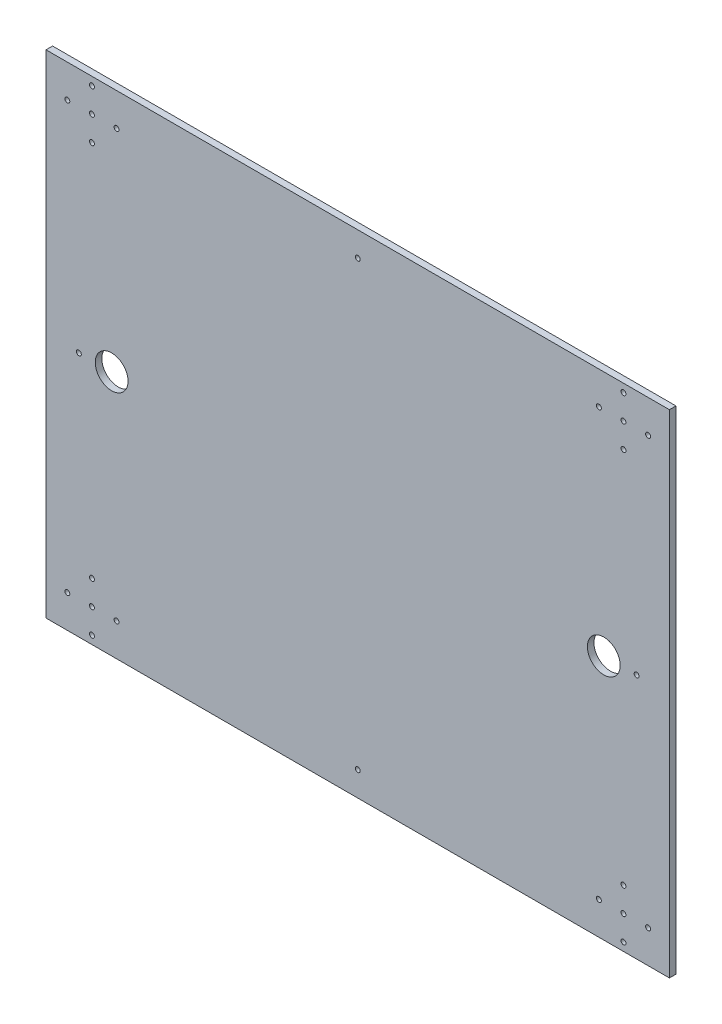
ISO-10303-21;
HEADER;
FILE_DESCRIPTION(('STEP AP214'),'2;1');
FILE_NAME('part.step','',(''),(''),'','','');
FILE_SCHEMA(('AUTOMOTIVE_DESIGN { 1 0 10303 214 1 1 1 1 }'));
ENDSEC;
DATA;
#1=APPLICATION_CONTEXT('core data for automotive mechanical design processes');
#2=APPLICATION_PROTOCOL_DEFINITION('international standard','automotive_design',2000,#1);
#3=PRODUCT_CONTEXT('',#1,'mechanical');
#4=PRODUCT('Part','Part','',(#3));
#5=PRODUCT_RELATED_PRODUCT_CATEGORY('part','',(#4));
#6=PRODUCT_DEFINITION_FORMATION('','',#4);
#7=PRODUCT_DEFINITION_CONTEXT('part definition',#1,'design');
#8=PRODUCT_DEFINITION('design','',#6,#7);
#9=PRODUCT_DEFINITION_SHAPE('','',#8);
#10=(LENGTH_UNIT() NAMED_UNIT(*) SI_UNIT(.MILLI.,.METRE.));
#11=(NAMED_UNIT(*) PLANE_ANGLE_UNIT() SI_UNIT($,.RADIAN.));
#12=(NAMED_UNIT(*) SI_UNIT($,.STERADIAN.) SOLID_ANGLE_UNIT());
#13=UNCERTAINTY_MEASURE_WITH_UNIT(LENGTH_MEASURE(1.E-05),#10,'distance_accuracy_value','');
#14=(GEOMETRIC_REPRESENTATION_CONTEXT(3) GLOBAL_UNCERTAINTY_ASSIGNED_CONTEXT((#13)) GLOBAL_UNIT_ASSIGNED_CONTEXT((#10,
#11,#12)) REPRESENTATION_CONTEXT('',''));
#15=CARTESIAN_POINT('',(0.,0.,0.));
#16=DIRECTION('',(0.,0.,1.));
#17=DIRECTION('',(1.,0.,0.));
#18=AXIS2_PLACEMENT_3D('',#15,#16,#17);
#19=CARTESIAN_POINT('',(-313.14988176555,-102.236334851958,4.));
#20=DIRECTION('',(1.,0.,0.));
#21=DIRECTION('',(0.,0.,-1.));
#22=AXIS2_PLACEMENT_3D('',#19,#20,#21);
#23=PLANE('',#22);
#24=DIRECTION('',(0.,-1.,0.));
#25=VECTOR('',#24,1.);
#26=CARTESIAN_POINT('',(-313.14988176555,-102.236334851958,0.));
#27=LINE('',#26,#25);
#28=CARTESIAN_POINT('',(-313.14988176555,197.763665148042,0.));
#29=VERTEX_POINT('',#28);
#30=CARTESIAN_POINT('',(-313.14988176555,-102.236334851958,0.));
#31=VERTEX_POINT('',#30);
#32=EDGE_CURVE('E98',#29,#31,#27,.T.);
#33=ORIENTED_EDGE('',*,*,#32,.T.);
#34=DIRECTION('',(0.,0.,-1.));
#35=VECTOR('',#34,1.);
#36=CARTESIAN_POINT('',(-313.14988176555,-102.236334851958,4.));
#37=LINE('',#36,#35);
#38=CARTESIAN_POINT('',(-313.14988176555,-102.236334851958,4.));
#39=VERTEX_POINT('',#38);
#40=EDGE_CURVE('E11',#39,#31,#37,.T.);
#41=ORIENTED_EDGE('',*,*,#40,.F.);
#42=DIRECTION('',(0.,-1.,0.));
#43=VECTOR('',#42,1.);
#44=CARTESIAN_POINT('',(-313.14988176555,-102.236334851958,4.));
#45=LINE('',#44,#43);
#46=CARTESIAN_POINT('',(-313.14988176555,197.763665148042,4.));
#47=VERTEX_POINT('',#46);
#48=EDGE_CURVE('E85',#47,#39,#45,.T.);
#49=ORIENTED_EDGE('',*,*,#48,.F.);
#50=DIRECTION('',(0.,0.,-1.));
#51=VECTOR('',#50,1.);
#52=CARTESIAN_POINT('',(-313.14988176555,197.763665148042,4.));
#53=LINE('',#52,#51);
#54=EDGE_CURVE('E94',#47,#29,#53,.T.);
#55=ORIENTED_EDGE('',*,*,#54,.T.);
#56=EDGE_LOOP('',(#33,#41,#49,#55));
#57=FACE_BOUND('',#56,.T.);
#58=ADVANCED_FACE('F33',(#57),#23,.F.);
#59=CARTESIAN_POINT('',(66.85011823445,-102.236334851958,4.));
#60=DIRECTION('',(0.,1.,0.));
#61=DIRECTION('',(0.,0.,1.));
#62=AXIS2_PLACEMENT_3D('',#59,#60,#61);
#63=PLANE('',#62);
#64=DIRECTION('',(1.,0.,0.));
#65=VECTOR('',#64,1.);
#66=CARTESIAN_POINT('',(66.85011823445,-102.236334851958,0.));
#67=LINE('',#66,#65);
#68=CARTESIAN_POINT('',(66.85011823445,-102.236334851958,0.));
#69=VERTEX_POINT('',#68);
#70=EDGE_CURVE('E89',#31,#69,#67,.T.);
#71=ORIENTED_EDGE('',*,*,#70,.T.);
#72=DIRECTION('',(0.,0.,-1.));
#73=VECTOR('',#72,1.);
#74=CARTESIAN_POINT('',(66.85011823445,-102.236334851958,4.));
#75=LINE('',#74,#73);
#76=CARTESIAN_POINT('',(66.85011823445,-102.236334851958,4.));
#77=VERTEX_POINT('',#76);
#78=EDGE_CURVE('E42',#77,#69,#75,.T.);
#79=ORIENTED_EDGE('',*,*,#78,.F.);
#80=DIRECTION('',(1.,0.,0.));
#81=VECTOR('',#80,1.);
#82=CARTESIAN_POINT('',(66.85011823445,-102.236334851958,4.));
#83=LINE('',#82,#81);
#84=EDGE_CURVE('E80',#39,#77,#83,.T.);
#85=ORIENTED_EDGE('',*,*,#84,.F.);
#86=ORIENTED_EDGE('',*,*,#40,.T.);
#87=EDGE_LOOP('',(#71,#79,#85,#86));
#88=FACE_BOUND('',#87,.T.);
#89=ADVANCED_FACE('F88',(#88),#63,.F.);
#90=CARTESIAN_POINT('',(66.85011823445,197.763665148042,4.));
#91=DIRECTION('',(-1.,0.,0.));
#92=DIRECTION('',(0.,0.,1.));
#93=AXIS2_PLACEMENT_3D('',#90,#91,#92);
#94=PLANE('',#93);
#95=DIRECTION('',(0.,1.,0.));
#96=VECTOR('',#95,1.);
#97=CARTESIAN_POINT('',(66.85011823445,197.763665148042,0.));
#98=LINE('',#97,#96);
#99=CARTESIAN_POINT('',(66.85011823445,197.763665148042,0.));
#100=VERTEX_POINT('',#99);
#101=EDGE_CURVE('E67',#69,#100,#98,.T.);
#102=ORIENTED_EDGE('',*,*,#101,.T.);
#103=DIRECTION('',(0.,0.,-1.));
#104=VECTOR('',#103,1.);
#105=CARTESIAN_POINT('',(66.85011823445,197.763665148042,4.));
#106=LINE('',#105,#104);
#107=CARTESIAN_POINT('',(66.85011823445,197.763665148042,4.));
#108=VERTEX_POINT('',#107);
#109=EDGE_CURVE('E90',#108,#100,#106,.T.);
#110=ORIENTED_EDGE('',*,*,#109,.F.);
#111=DIRECTION('',(0.,1.,0.));
#112=VECTOR('',#111,1.);
#113=CARTESIAN_POINT('',(66.85011823445,197.763665148042,4.));
#114=LINE('',#113,#112);
#115=EDGE_CURVE('E83',#77,#108,#114,.T.);
#116=ORIENTED_EDGE('',*,*,#115,.F.);
#117=ORIENTED_EDGE('',*,*,#78,.T.);
#118=EDGE_LOOP('',(#102,#110,#116,#117));
#119=FACE_BOUND('',#118,.T.);
#120=ADVANCED_FACE('F92',(#119),#94,.F.);
#121=CARTESIAN_POINT('',(-313.14988176555,197.763665148042,4.));
#122=DIRECTION('',(0.,-1.,0.));
#123=DIRECTION('',(0.,0.,-1.));
#124=AXIS2_PLACEMENT_3D('',#121,#122,#123);
#125=PLANE('',#124);
#126=DIRECTION('',(-1.,0.,0.));
#127=VECTOR('',#126,1.);
#128=CARTESIAN_POINT('',(-313.14988176555,197.763665148042,0.));
#129=LINE('',#128,#127);
#130=EDGE_CURVE('E73',#100,#29,#129,.T.);
#131=ORIENTED_EDGE('',*,*,#130,.T.);
#132=ORIENTED_EDGE('',*,*,#54,.F.);
#133=DIRECTION('',(-1.,0.,0.));
#134=VECTOR('',#133,1.);
#135=CARTESIAN_POINT('',(-313.14988176555,197.763665148042,4.));
#136=LINE('',#135,#134);
#137=EDGE_CURVE('E50',#108,#47,#136,.T.);
#138=ORIENTED_EDGE('',*,*,#137,.F.);
#139=ORIENTED_EDGE('',*,*,#109,.T.);
#140=EDGE_LOOP('',(#131,#132,#138,#139));
#141=FACE_BOUND('',#140,.T.);
#142=ADVANCED_FACE('F106',(#141),#125,.F.);
#143=CARTESIAN_POINT('',(0.,0.,4.));
#144=DIRECTION('',(0.,0.,-1.));
#145=DIRECTION('',(-1.,0.,0.));
#146=AXIS2_PLACEMENT_3D('',#143,#144,#145);
#147=PLANE('',#146);
#148=CARTESIAN_POINT('',(-123.149881765551,-87.2363348519579,4.));
#149=DIRECTION('',(0.,0.,-1.));
#150=DIRECTION('',(-1.,0.,0.));
#151=AXIS2_PLACEMENT_3D('',#148,#149,#150);
#152=CIRCLE('',#151,1.5);
#153=CARTESIAN_POINT('',(-124.649881765551,-87.2363348519579,4.));
#154=VERTEX_POINT('',#153);
#155=EDGE_CURVE('E256',#154,#154,#152,.T.);
#156=ORIENTED_EDGE('',*,*,#155,.T.);
#157=EDGE_LOOP('',(#156));
#158=FACE_BOUND('',#157,.T.);
#159=CARTESIAN_POINT('',(46.85011823445,47.7636651480409,4.));
#160=DIRECTION('',(0.,0.,-1.));
#161=DIRECTION('',(-1.,0.,0.));
#162=AXIS2_PLACEMENT_3D('',#159,#160,#161);
#163=CIRCLE('',#162,1.5);
#164=CARTESIAN_POINT('',(45.35011823445,47.7636651480409,4.));
#165=VERTEX_POINT('',#164);
#166=EDGE_CURVE('E250',#165,#165,#163,.T.);
#167=ORIENTED_EDGE('',*,*,#166,.T.);
#168=EDGE_LOOP('',(#167));
#169=FACE_BOUND('',#168,.T.);
#170=CARTESIAN_POINT('',(-123.14988176555,182.763665148042,4.));
#171=DIRECTION('',(0.,0.,-1.));
#172=DIRECTION('',(-1.,0.,0.));
#173=AXIS2_PLACEMENT_3D('',#170,#171,#172);
#174=CIRCLE('',#173,1.5);
#175=CARTESIAN_POINT('',(-124.64988176555,182.763665148042,4.));
#176=VERTEX_POINT('',#175);
#177=EDGE_CURVE('E244',#176,#176,#174,.T.);
#178=ORIENTED_EDGE('',*,*,#177,.T.);
#179=EDGE_LOOP('',(#178));
#180=FACE_BOUND('',#179,.T.);
#181=CARTESIAN_POINT('',(-293.14988176555,47.7636651480421,4.));
#182=DIRECTION('',(0.,0.,-1.));
#183=DIRECTION('',(-1.,0.,0.));
#184=AXIS2_PLACEMENT_3D('',#181,#182,#183);
#185=CIRCLE('',#184,1.50000000000002);
#186=CARTESIAN_POINT('',(-294.64988176555,47.7636651480421,4.));
#187=VERTEX_POINT('',#186);
#188=EDGE_CURVE('E238',#187,#187,#185,.T.);
#189=ORIENTED_EDGE('',*,*,#188,.T.);
#190=EDGE_LOOP('',(#189));
#191=FACE_BOUND('',#190,.T.);
#192=CARTESIAN_POINT('',(38.85011823445,192.76366514804,4.));
#193=DIRECTION('',(0.,0.,-1.));
#194=DIRECTION('',(-1.,0.,0.));
#195=AXIS2_PLACEMENT_3D('',#192,#193,#194);
#196=CIRCLE('',#195,1.50000000000002);
#197=CARTESIAN_POINT('',(37.3501182344499,192.76366514804,4.));
#198=VERTEX_POINT('',#197);
#199=EDGE_CURVE('E235',#198,#198,#196,.T.);
#200=ORIENTED_EDGE('',*,*,#199,.T.);
#201=EDGE_LOOP('',(#200));
#202=FACE_BOUND('',#201,.T.);
#203=CARTESIAN_POINT('',(23.85011823445,177.76366514804,4.));
#204=DIRECTION('',(0.,0.,-1.));
#205=DIRECTION('',(-1.,0.,0.));
#206=AXIS2_PLACEMENT_3D('',#203,#204,#205);
#207=CIRCLE('',#206,1.50000000000002);
#208=CARTESIAN_POINT('',(22.35011823445,177.76366514804,4.));
#209=VERTEX_POINT('',#208);
#210=EDGE_CURVE('E229',#209,#209,#207,.T.);
#211=ORIENTED_EDGE('',*,*,#210,.T.);
#212=EDGE_LOOP('',(#211));
#213=FACE_BOUND('',#212,.T.);
#214=CARTESIAN_POINT('',(38.85011823445,177.76366514804,4.));
#215=DIRECTION('',(0.,0.,-1.));
#216=DIRECTION('',(-1.,0.,0.));
#217=AXIS2_PLACEMENT_3D('',#214,#215,#216);
#218=CIRCLE('',#217,1.50000000000002);
#219=CARTESIAN_POINT('',(37.35011823445,177.76366514804,4.));
#220=VERTEX_POINT('',#219);
#221=EDGE_CURVE('E223',#220,#220,#218,.T.);
#222=ORIENTED_EDGE('',*,*,#221,.T.);
#223=EDGE_LOOP('',(#222));
#224=FACE_BOUND('',#223,.T.);
#225=CARTESIAN_POINT('',(53.85011823445,177.76366514804,4.));
#226=DIRECTION('',(0.,0.,-1.));
#227=DIRECTION('',(-1.,0.,0.));
#228=AXIS2_PLACEMENT_3D('',#225,#226,#227);
#229=CIRCLE('',#228,1.50000000000002);
#230=CARTESIAN_POINT('',(52.35011823445,177.76366514804,4.));
#231=VERTEX_POINT('',#230);
#232=EDGE_CURVE('E217',#231,#231,#229,.T.);
#233=ORIENTED_EDGE('',*,*,#232,.T.);
#234=EDGE_LOOP('',(#233));
#235=FACE_BOUND('',#234,.T.);
#236=CARTESIAN_POINT('',(38.8501182344501,162.76366514804,4.));
#237=DIRECTION('',(0.,0.,-1.));
#238=DIRECTION('',(-1.,0.,0.));
#239=AXIS2_PLACEMENT_3D('',#236,#237,#238);
#240=CIRCLE('',#239,1.50000000000002);
#241=CARTESIAN_POINT('',(37.3501182344501,162.76366514804,4.));
#242=VERTEX_POINT('',#241);
#243=EDGE_CURVE('E211',#242,#242,#240,.T.);
#244=ORIENTED_EDGE('',*,*,#243,.T.);
#245=EDGE_LOOP('',(#244));
#246=FACE_BOUND('',#245,.T.);
#247=CARTESIAN_POINT('',(23.8501182344473,-82.2363348519603,4.));
#248=DIRECTION('',(0.,0.,-1.));
#249=DIRECTION('',(-1.,0.,0.));
#250=AXIS2_PLACEMENT_3D('',#247,#248,#249);
#251=CIRCLE('',#250,1.50000000000002);
#252=CARTESIAN_POINT('',(22.3501182344472,-82.2363348519603,4.));
#253=VERTEX_POINT('',#252);
#254=EDGE_CURVE('E205',#253,#253,#251,.T.);
#255=ORIENTED_EDGE('',*,*,#254,.T.);
#256=EDGE_LOOP('',(#255));
#257=FACE_BOUND('',#256,.T.);
#258=CARTESIAN_POINT('',(38.8501182344473,-82.2363348519602,4.));
#259=DIRECTION('',(0.,0.,-1.));
#260=DIRECTION('',(-1.,0.,0.));
#261=AXIS2_PLACEMENT_3D('',#258,#259,#260);
#262=CIRCLE('',#261,1.50000000000002);
#263=CARTESIAN_POINT('',(37.3501182344473,-82.2363348519602,4.));
#264=VERTEX_POINT('',#263);
#265=EDGE_CURVE('E199',#264,#264,#262,.T.);
#266=ORIENTED_EDGE('',*,*,#265,.T.);
#267=EDGE_LOOP('',(#266));
#268=FACE_BOUND('',#267,.T.);
#269=CARTESIAN_POINT('',(53.8501182344473,-82.2363348519602,4.));
#270=DIRECTION('',(0.,0.,-1.));
#271=DIRECTION('',(-1.,0.,0.));
#272=AXIS2_PLACEMENT_3D('',#269,#270,#271);
#273=CIRCLE('',#272,1.50000000000002);
#274=CARTESIAN_POINT('',(52.3501182344473,-82.2363348519602,4.));
#275=VERTEX_POINT('',#274);
#276=EDGE_CURVE('E193',#275,#275,#273,.T.);
#277=ORIENTED_EDGE('',*,*,#276,.T.);
#278=EDGE_LOOP('',(#277));
#279=FACE_BOUND('',#278,.T.);
#280=CARTESIAN_POINT('',(-285.149881765553,-67.236334851958,4.));
#281=DIRECTION('',(0.,0.,-1.));
#282=DIRECTION('',(-1.,0.,0.));
#283=AXIS2_PLACEMENT_3D('',#280,#281,#282);
#284=CIRCLE('',#283,1.50000000000002);
#285=CARTESIAN_POINT('',(-286.649881765553,-67.236334851958,4.));
#286=VERTEX_POINT('',#285);
#287=EDGE_CURVE('E187',#286,#286,#284,.T.);
#288=ORIENTED_EDGE('',*,*,#287,.T.);
#289=EDGE_LOOP('',(#288));
#290=FACE_BOUND('',#289,.T.);
#291=CARTESIAN_POINT('',(-300.149881765553,-82.236334851958,4.));
#292=DIRECTION('',(0.,0.,-1.));
#293=DIRECTION('',(-1.,0.,0.));
#294=AXIS2_PLACEMENT_3D('',#291,#292,#293);
#295=CIRCLE('',#294,1.50000000000002);
#296=CARTESIAN_POINT('',(-301.649881765553,-82.236334851958,4.));
#297=VERTEX_POINT('',#296);
#298=EDGE_CURVE('E181',#297,#297,#295,.T.);
#299=ORIENTED_EDGE('',*,*,#298,.T.);
#300=EDGE_LOOP('',(#299));
#301=FACE_BOUND('',#300,.T.);
#302=CARTESIAN_POINT('',(-285.149881765553,-97.2363348519579,4.));
#303=DIRECTION('',(0.,0.,-1.));
#304=DIRECTION('',(-1.,0.,0.));
#305=AXIS2_PLACEMENT_3D('',#302,#303,#304);
#306=CIRCLE('',#305,1.50000000000002);
#307=CARTESIAN_POINT('',(-286.649881765553,-97.2363348519579,4.));
#308=VERTEX_POINT('',#307);
#309=EDGE_CURVE('E175',#308,#308,#306,.T.);
#310=ORIENTED_EDGE('',*,*,#309,.T.);
#311=EDGE_LOOP('',(#310));
#312=FACE_BOUND('',#311,.T.);
#313=CARTESIAN_POINT('',(-270.149881765553,-82.2363348519579,4.));
#314=DIRECTION('',(0.,0.,-1.));
#315=DIRECTION('',(-1.,0.,0.));
#316=AXIS2_PLACEMENT_3D('',#313,#314,#315);
#317=CIRCLE('',#316,1.50000000000002);
#318=CARTESIAN_POINT('',(-271.649881765553,-82.2363348519579,4.));
#319=VERTEX_POINT('',#318);
#320=EDGE_CURVE('E169',#319,#319,#317,.T.);
#321=ORIENTED_EDGE('',*,*,#320,.T.);
#322=EDGE_LOOP('',(#321));
#323=FACE_BOUND('',#322,.T.);
#324=CARTESIAN_POINT('',(-285.14988176555,192.763665148042,4.));
#325=DIRECTION('',(0.,0.,-1.));
#326=DIRECTION('',(-1.,0.,0.));
#327=AXIS2_PLACEMENT_3D('',#324,#325,#326);
#328=CIRCLE('',#327,1.50000000000002);
#329=CARTESIAN_POINT('',(-286.64988176555,192.763665148042,4.));
#330=VERTEX_POINT('',#329);
#331=EDGE_CURVE('E163',#330,#330,#328,.T.);
#332=ORIENTED_EDGE('',*,*,#331,.T.);
#333=EDGE_LOOP('',(#332));
#334=FACE_BOUND('',#333,.T.);
#335=CARTESIAN_POINT('',(-270.14988176555,177.763665148042,4.));
#336=DIRECTION('',(0.,0.,-1.));
#337=DIRECTION('',(-1.,0.,0.));
#338=AXIS2_PLACEMENT_3D('',#335,#336,#337);
#339=CIRCLE('',#338,1.50000000000002);
#340=CARTESIAN_POINT('',(-271.64988176555,177.763665148042,4.));
#341=VERTEX_POINT('',#340);
#342=EDGE_CURVE('E157',#341,#341,#339,.T.);
#343=ORIENTED_EDGE('',*,*,#342,.T.);
#344=EDGE_LOOP('',(#343));
#345=FACE_BOUND('',#344,.T.);
#346=CARTESIAN_POINT('',(-285.14988176555,162.763665148042,4.));
#347=DIRECTION('',(0.,0.,-1.));
#348=DIRECTION('',(-1.,0.,0.));
#349=AXIS2_PLACEMENT_3D('',#346,#347,#348);
#350=CIRCLE('',#349,1.50000000000002);
#351=CARTESIAN_POINT('',(-286.64988176555,162.763665148042,4.));
#352=VERTEX_POINT('',#351);
#353=EDGE_CURVE('E151',#352,#352,#350,.T.);
#354=ORIENTED_EDGE('',*,*,#353,.T.);
#355=EDGE_LOOP('',(#354));
#356=FACE_BOUND('',#355,.T.);
#357=CARTESIAN_POINT('',(38.8501182344474,-97.2363348519602,4.));
#358=DIRECTION('',(0.,0.,-1.));
#359=DIRECTION('',(-1.,0.,0.));
#360=AXIS2_PLACEMENT_3D('',#357,#358,#359);
#361=CIRCLE('',#360,1.50000000000002);
#362=CARTESIAN_POINT('',(37.3501182344474,-97.2363348519602,4.));
#363=VERTEX_POINT('',#362);
#364=EDGE_CURVE('E145',#363,#363,#361,.T.);
#365=ORIENTED_EDGE('',*,*,#364,.T.);
#366=EDGE_LOOP('',(#365));
#367=FACE_BOUND('',#366,.T.);
#368=CARTESIAN_POINT('',(38.8501182344472,-67.2363348519602,4.));
#369=DIRECTION('',(0.,0.,-1.));
#370=DIRECTION('',(-1.,0.,0.));
#371=AXIS2_PLACEMENT_3D('',#368,#369,#370);
#372=CIRCLE('',#371,1.50000000000002);
#373=CARTESIAN_POINT('',(37.3501182344472,-67.2363348519602,4.));
#374=VERTEX_POINT('',#373);
#375=EDGE_CURVE('E139',#374,#374,#372,.T.);
#376=ORIENTED_EDGE('',*,*,#375,.T.);
#377=EDGE_LOOP('',(#376));
#378=FACE_BOUND('',#377,.T.);
#379=CARTESIAN_POINT('',(-285.149881765553,-82.2363348519579,4.));
#380=DIRECTION('',(0.,0.,-1.));
#381=DIRECTION('',(-1.,0.,0.));
#382=AXIS2_PLACEMENT_3D('',#379,#380,#381);
#383=CIRCLE('',#382,1.50000000000002);
#384=CARTESIAN_POINT('',(-286.649881765553,-82.2363348519579,4.));
#385=VERTEX_POINT('',#384);
#386=EDGE_CURVE('E133',#385,#385,#383,.T.);
#387=ORIENTED_EDGE('',*,*,#386,.T.);
#388=EDGE_LOOP('',(#387));
#389=FACE_BOUND('',#388,.T.);
#390=CARTESIAN_POINT('',(-285.14988176555,177.763665148042,4.));
#391=DIRECTION('',(0.,0.,-1.));
#392=DIRECTION('',(-1.,0.,0.));
#393=AXIS2_PLACEMENT_3D('',#390,#391,#392);
#394=CIRCLE('',#393,1.50000000000002);
#395=CARTESIAN_POINT('',(-286.64988176555,177.763665148042,4.));
#396=VERTEX_POINT('',#395);
#397=EDGE_CURVE('E127',#396,#396,#394,.T.);
#398=ORIENTED_EDGE('',*,*,#397,.T.);
#399=EDGE_LOOP('',(#398));
#400=FACE_BOUND('',#399,.T.);
#401=CARTESIAN_POINT('',(-300.14988176555,177.763665148042,4.));
#402=DIRECTION('',(0.,0.,-1.));
#403=DIRECTION('',(-1.,0.,0.));
#404=AXIS2_PLACEMENT_3D('',#401,#402,#403);
#405=CIRCLE('',#404,1.50000000000002);
#406=CARTESIAN_POINT('',(-301.64988176555,177.763665148042,4.));
#407=VERTEX_POINT('',#406);
#408=EDGE_CURVE('E120',#407,#407,#405,.T.);
#409=ORIENTED_EDGE('',*,*,#408,.T.);
#410=EDGE_LOOP('',(#409));
#411=FACE_BOUND('',#410,.T.);
#412=CARTESIAN_POINT('',(-273.14988176555,47.7636651480421,4.));
#413=DIRECTION('',(0.,0.,1.));
#414=DIRECTION('',(1.,0.,0.));
#415=AXIS2_PLACEMENT_3D('',#412,#413,#414);
#416=CIRCLE('',#415,10.);
#417=CARTESIAN_POINT('',(-263.14988176555,47.7636651480421,4.));
#418=VERTEX_POINT('',#417);
#419=EDGE_CURVE('E117',#418,#418,#416,.T.);
#420=ORIENTED_EDGE('',*,*,#419,.F.);
#421=EDGE_LOOP('',(#420));
#422=FACE_BOUND('',#421,.T.);
#423=CARTESIAN_POINT('',(26.85011823445,47.7636651480421,4.));
#424=DIRECTION('',(0.,0.,1.));
#425=DIRECTION('',(1.,0.,0.));
#426=AXIS2_PLACEMENT_3D('',#423,#424,#425);
#427=CIRCLE('',#426,10.);
#428=CARTESIAN_POINT('',(36.85011823445,47.7636651480421,4.));
#429=VERTEX_POINT('',#428);
#430=EDGE_CURVE('E114',#429,#429,#427,.T.);
#431=ORIENTED_EDGE('',*,*,#430,.F.);
#432=EDGE_LOOP('',(#431));
#433=FACE_BOUND('',#432,.T.);
#434=ORIENTED_EDGE('',*,*,#48,.T.);
#435=ORIENTED_EDGE('',*,*,#84,.T.);
#436=ORIENTED_EDGE('',*,*,#115,.T.);
#437=ORIENTED_EDGE('',*,*,#137,.T.);
#438=EDGE_LOOP('',(#434,#435,#436,#437));
#439=FACE_BOUND('',#438,.T.);
#440=ADVANCED_FACE('F81',(#158,#169,#180,#191,#202,#213,#224,#235,#246,#257,#268,#279,#290,#301,
#312,#323,#334,#345,#356,#367,#378,#389,#400,#411,#422,#433,#439),#147,.F.);
#441=CARTESIAN_POINT('',(0.,0.,0.));
#442=DIRECTION('',(0.,0.,-1.));
#443=DIRECTION('',(-1.,0.,0.));
#444=AXIS2_PLACEMENT_3D('',#441,#442,#443);
#445=PLANE('',#444);
#446=CARTESIAN_POINT('',(-123.149881765551,-87.2363348519579,0.));
#447=DIRECTION('',(0.,0.,-1.));
#448=DIRECTION('',(-1.,0.,0.));
#449=AXIS2_PLACEMENT_3D('',#446,#447,#448);
#450=CIRCLE('',#449,1.5);
#451=CARTESIAN_POINT('',(-124.649881765551,-87.2363348519579,0.));
#452=VERTEX_POINT('',#451);
#453=EDGE_CURVE('E259',#452,#452,#450,.T.);
#454=ORIENTED_EDGE('',*,*,#453,.F.);
#455=EDGE_LOOP('',(#454));
#456=FACE_BOUND('',#455,.T.);
#457=CARTESIAN_POINT('',(46.85011823445,47.7636651480409,0.));
#458=DIRECTION('',(0.,0.,-1.));
#459=DIRECTION('',(-1.,0.,0.));
#460=AXIS2_PLACEMENT_3D('',#457,#458,#459);
#461=CIRCLE('',#460,1.5);
#462=CARTESIAN_POINT('',(45.35011823445,47.7636651480409,0.));
#463=VERTEX_POINT('',#462);
#464=EDGE_CURVE('E253',#463,#463,#461,.T.);
#465=ORIENTED_EDGE('',*,*,#464,.F.);
#466=EDGE_LOOP('',(#465));
#467=FACE_BOUND('',#466,.T.);
#468=CARTESIAN_POINT('',(-123.14988176555,182.763665148042,0.));
#469=DIRECTION('',(0.,0.,-1.));
#470=DIRECTION('',(-1.,0.,0.));
#471=AXIS2_PLACEMENT_3D('',#468,#469,#470);
#472=CIRCLE('',#471,1.5);
#473=CARTESIAN_POINT('',(-124.64988176555,182.763665148042,0.));
#474=VERTEX_POINT('',#473);
#475=EDGE_CURVE('E247',#474,#474,#472,.T.);
#476=ORIENTED_EDGE('',*,*,#475,.F.);
#477=EDGE_LOOP('',(#476));
#478=FACE_BOUND('',#477,.T.);
#479=CARTESIAN_POINT('',(-293.14988176555,47.7636651480421,0.));
#480=DIRECTION('',(0.,0.,-1.));
#481=DIRECTION('',(-1.,0.,0.));
#482=AXIS2_PLACEMENT_3D('',#479,#480,#481);
#483=CIRCLE('',#482,1.50000000000002);
#484=CARTESIAN_POINT('',(-294.64988176555,47.7636651480421,0.));
#485=VERTEX_POINT('',#484);
#486=EDGE_CURVE('E241',#485,#485,#483,.T.);
#487=ORIENTED_EDGE('',*,*,#486,.F.);
#488=EDGE_LOOP('',(#487));
#489=FACE_BOUND('',#488,.T.);
#490=CARTESIAN_POINT('',(38.85011823445,192.76366514804,0.));
#491=DIRECTION('',(0.,0.,-1.));
#492=DIRECTION('',(-1.,0.,0.));
#493=AXIS2_PLACEMENT_3D('',#490,#491,#492);
#494=CIRCLE('',#493,1.50000000000002);
#495=CARTESIAN_POINT('',(37.3501182344499,192.76366514804,0.));
#496=VERTEX_POINT('',#495);
#497=EDGE_CURVE('E232',#496,#496,#494,.T.);
#498=ORIENTED_EDGE('',*,*,#497,.F.);
#499=EDGE_LOOP('',(#498));
#500=FACE_BOUND('',#499,.T.);
#501=CARTESIAN_POINT('',(23.85011823445,177.76366514804,0.));
#502=DIRECTION('',(0.,0.,-1.));
#503=DIRECTION('',(-1.,0.,0.));
#504=AXIS2_PLACEMENT_3D('',#501,#502,#503);
#505=CIRCLE('',#504,1.50000000000002);
#506=CARTESIAN_POINT('',(22.35011823445,177.76366514804,0.));
#507=VERTEX_POINT('',#506);
#508=EDGE_CURVE('E226',#507,#507,#505,.T.);
#509=ORIENTED_EDGE('',*,*,#508,.F.);
#510=EDGE_LOOP('',(#509));
#511=FACE_BOUND('',#510,.T.);
#512=CARTESIAN_POINT('',(38.85011823445,177.76366514804,0.));
#513=DIRECTION('',(0.,0.,-1.));
#514=DIRECTION('',(-1.,0.,0.));
#515=AXIS2_PLACEMENT_3D('',#512,#513,#514);
#516=CIRCLE('',#515,1.50000000000002);
#517=CARTESIAN_POINT('',(37.35011823445,177.76366514804,0.));
#518=VERTEX_POINT('',#517);
#519=EDGE_CURVE('E220',#518,#518,#516,.T.);
#520=ORIENTED_EDGE('',*,*,#519,.F.);
#521=EDGE_LOOP('',(#520));
#522=FACE_BOUND('',#521,.T.);
#523=CARTESIAN_POINT('',(53.85011823445,177.76366514804,0.));
#524=DIRECTION('',(0.,0.,-1.));
#525=DIRECTION('',(-1.,0.,0.));
#526=AXIS2_PLACEMENT_3D('',#523,#524,#525);
#527=CIRCLE('',#526,1.50000000000002);
#528=CARTESIAN_POINT('',(52.35011823445,177.76366514804,0.));
#529=VERTEX_POINT('',#528);
#530=EDGE_CURVE('E214',#529,#529,#527,.T.);
#531=ORIENTED_EDGE('',*,*,#530,.F.);
#532=EDGE_LOOP('',(#531));
#533=FACE_BOUND('',#532,.T.);
#534=CARTESIAN_POINT('',(38.8501182344501,162.76366514804,0.));
#535=DIRECTION('',(0.,0.,-1.));
#536=DIRECTION('',(-1.,0.,0.));
#537=AXIS2_PLACEMENT_3D('',#534,#535,#536);
#538=CIRCLE('',#537,1.50000000000002);
#539=CARTESIAN_POINT('',(37.3501182344501,162.76366514804,0.));
#540=VERTEX_POINT('',#539);
#541=EDGE_CURVE('E208',#540,#540,#538,.T.);
#542=ORIENTED_EDGE('',*,*,#541,.F.);
#543=EDGE_LOOP('',(#542));
#544=FACE_BOUND('',#543,.T.);
#545=CARTESIAN_POINT('',(23.8501182344473,-82.2363348519603,0.));
#546=DIRECTION('',(0.,0.,-1.));
#547=DIRECTION('',(-1.,0.,0.));
#548=AXIS2_PLACEMENT_3D('',#545,#546,#547);
#549=CIRCLE('',#548,1.50000000000002);
#550=CARTESIAN_POINT('',(22.3501182344472,-82.2363348519603,0.));
#551=VERTEX_POINT('',#550);
#552=EDGE_CURVE('E202',#551,#551,#549,.T.);
#553=ORIENTED_EDGE('',*,*,#552,.F.);
#554=EDGE_LOOP('',(#553));
#555=FACE_BOUND('',#554,.T.);
#556=CARTESIAN_POINT('',(38.8501182344473,-82.2363348519602,0.));
#557=DIRECTION('',(0.,0.,-1.));
#558=DIRECTION('',(-1.,0.,0.));
#559=AXIS2_PLACEMENT_3D('',#556,#557,#558);
#560=CIRCLE('',#559,1.50000000000002);
#561=CARTESIAN_POINT('',(37.3501182344473,-82.2363348519602,0.));
#562=VERTEX_POINT('',#561);
#563=EDGE_CURVE('E196',#562,#562,#560,.T.);
#564=ORIENTED_EDGE('',*,*,#563,.F.);
#565=EDGE_LOOP('',(#564));
#566=FACE_BOUND('',#565,.T.);
#567=CARTESIAN_POINT('',(53.8501182344473,-82.2363348519602,0.));
#568=DIRECTION('',(0.,0.,-1.));
#569=DIRECTION('',(-1.,0.,0.));
#570=AXIS2_PLACEMENT_3D('',#567,#568,#569);
#571=CIRCLE('',#570,1.50000000000002);
#572=CARTESIAN_POINT('',(52.3501182344473,-82.2363348519602,0.));
#573=VERTEX_POINT('',#572);
#574=EDGE_CURVE('E190',#573,#573,#571,.T.);
#575=ORIENTED_EDGE('',*,*,#574,.F.);
#576=EDGE_LOOP('',(#575));
#577=FACE_BOUND('',#576,.T.);
#578=CARTESIAN_POINT('',(-285.149881765553,-67.236334851958,0.));
#579=DIRECTION('',(0.,0.,-1.));
#580=DIRECTION('',(-1.,0.,0.));
#581=AXIS2_PLACEMENT_3D('',#578,#579,#580);
#582=CIRCLE('',#581,1.50000000000002);
#583=CARTESIAN_POINT('',(-286.649881765553,-67.236334851958,0.));
#584=VERTEX_POINT('',#583);
#585=EDGE_CURVE('E184',#584,#584,#582,.T.);
#586=ORIENTED_EDGE('',*,*,#585,.F.);
#587=EDGE_LOOP('',(#586));
#588=FACE_BOUND('',#587,.T.);
#589=CARTESIAN_POINT('',(-300.149881765553,-82.236334851958,0.));
#590=DIRECTION('',(0.,0.,-1.));
#591=DIRECTION('',(-1.,0.,0.));
#592=AXIS2_PLACEMENT_3D('',#589,#590,#591);
#593=CIRCLE('',#592,1.50000000000002);
#594=CARTESIAN_POINT('',(-301.649881765553,-82.236334851958,0.));
#595=VERTEX_POINT('',#594);
#596=EDGE_CURVE('E178',#595,#595,#593,.T.);
#597=ORIENTED_EDGE('',*,*,#596,.F.);
#598=EDGE_LOOP('',(#597));
#599=FACE_BOUND('',#598,.T.);
#600=CARTESIAN_POINT('',(-285.149881765553,-97.2363348519579,0.));
#601=DIRECTION('',(0.,0.,-1.));
#602=DIRECTION('',(-1.,0.,0.));
#603=AXIS2_PLACEMENT_3D('',#600,#601,#602);
#604=CIRCLE('',#603,1.50000000000002);
#605=CARTESIAN_POINT('',(-286.649881765553,-97.2363348519579,0.));
#606=VERTEX_POINT('',#605);
#607=EDGE_CURVE('E172',#606,#606,#604,.T.);
#608=ORIENTED_EDGE('',*,*,#607,.F.);
#609=EDGE_LOOP('',(#608));
#610=FACE_BOUND('',#609,.T.);
#611=CARTESIAN_POINT('',(-270.149881765553,-82.2363348519579,0.));
#612=DIRECTION('',(0.,0.,-1.));
#613=DIRECTION('',(-1.,0.,0.));
#614=AXIS2_PLACEMENT_3D('',#611,#612,#613);
#615=CIRCLE('',#614,1.50000000000002);
#616=CARTESIAN_POINT('',(-271.649881765553,-82.2363348519579,0.));
#617=VERTEX_POINT('',#616);
#618=EDGE_CURVE('E166',#617,#617,#615,.T.);
#619=ORIENTED_EDGE('',*,*,#618,.F.);
#620=EDGE_LOOP('',(#619));
#621=FACE_BOUND('',#620,.T.);
#622=CARTESIAN_POINT('',(-285.14988176555,192.763665148042,0.));
#623=DIRECTION('',(0.,0.,-1.));
#624=DIRECTION('',(-1.,0.,0.));
#625=AXIS2_PLACEMENT_3D('',#622,#623,#624);
#626=CIRCLE('',#625,1.50000000000002);
#627=CARTESIAN_POINT('',(-286.64988176555,192.763665148042,0.));
#628=VERTEX_POINT('',#627);
#629=EDGE_CURVE('E160',#628,#628,#626,.T.);
#630=ORIENTED_EDGE('',*,*,#629,.F.);
#631=EDGE_LOOP('',(#630));
#632=FACE_BOUND('',#631,.T.);
#633=CARTESIAN_POINT('',(-270.14988176555,177.763665148042,0.));
#634=DIRECTION('',(0.,0.,-1.));
#635=DIRECTION('',(-1.,0.,0.));
#636=AXIS2_PLACEMENT_3D('',#633,#634,#635);
#637=CIRCLE('',#636,1.50000000000002);
#638=CARTESIAN_POINT('',(-271.64988176555,177.763665148042,0.));
#639=VERTEX_POINT('',#638);
#640=EDGE_CURVE('E154',#639,#639,#637,.T.);
#641=ORIENTED_EDGE('',*,*,#640,.F.);
#642=EDGE_LOOP('',(#641));
#643=FACE_BOUND('',#642,.T.);
#644=CARTESIAN_POINT('',(-285.14988176555,162.763665148042,0.));
#645=DIRECTION('',(0.,0.,-1.));
#646=DIRECTION('',(-1.,0.,0.));
#647=AXIS2_PLACEMENT_3D('',#644,#645,#646);
#648=CIRCLE('',#647,1.50000000000002);
#649=CARTESIAN_POINT('',(-286.64988176555,162.763665148042,0.));
#650=VERTEX_POINT('',#649);
#651=EDGE_CURVE('E148',#650,#650,#648,.T.);
#652=ORIENTED_EDGE('',*,*,#651,.F.);
#653=EDGE_LOOP('',(#652));
#654=FACE_BOUND('',#653,.T.);
#655=CARTESIAN_POINT('',(38.8501182344474,-97.2363348519602,0.));
#656=DIRECTION('',(0.,0.,-1.));
#657=DIRECTION('',(-1.,0.,0.));
#658=AXIS2_PLACEMENT_3D('',#655,#656,#657);
#659=CIRCLE('',#658,1.50000000000002);
#660=CARTESIAN_POINT('',(37.3501182344474,-97.2363348519602,0.));
#661=VERTEX_POINT('',#660);
#662=EDGE_CURVE('E142',#661,#661,#659,.T.);
#663=ORIENTED_EDGE('',*,*,#662,.F.);
#664=EDGE_LOOP('',(#663));
#665=FACE_BOUND('',#664,.T.);
#666=CARTESIAN_POINT('',(38.8501182344472,-67.2363348519602,0.));
#667=DIRECTION('',(0.,0.,-1.));
#668=DIRECTION('',(-1.,0.,0.));
#669=AXIS2_PLACEMENT_3D('',#666,#667,#668);
#670=CIRCLE('',#669,1.50000000000002);
#671=CARTESIAN_POINT('',(37.3501182344472,-67.2363348519602,0.));
#672=VERTEX_POINT('',#671);
#673=EDGE_CURVE('E136',#672,#672,#670,.T.);
#674=ORIENTED_EDGE('',*,*,#673,.F.);
#675=EDGE_LOOP('',(#674));
#676=FACE_BOUND('',#675,.T.);
#677=CARTESIAN_POINT('',(-285.149881765553,-82.2363348519579,0.));
#678=DIRECTION('',(0.,0.,-1.));
#679=DIRECTION('',(-1.,0.,0.));
#680=AXIS2_PLACEMENT_3D('',#677,#678,#679);
#681=CIRCLE('',#680,1.50000000000002);
#682=CARTESIAN_POINT('',(-286.649881765553,-82.2363348519579,0.));
#683=VERTEX_POINT('',#682);
#684=EDGE_CURVE('E130',#683,#683,#681,.T.);
#685=ORIENTED_EDGE('',*,*,#684,.F.);
#686=EDGE_LOOP('',(#685));
#687=FACE_BOUND('',#686,.T.);
#688=CARTESIAN_POINT('',(-285.14988176555,177.763665148042,0.));
#689=DIRECTION('',(0.,0.,-1.));
#690=DIRECTION('',(-1.,0.,0.));
#691=AXIS2_PLACEMENT_3D('',#688,#689,#690);
#692=CIRCLE('',#691,1.50000000000002);
#693=CARTESIAN_POINT('',(-286.64988176555,177.763665148042,0.));
#694=VERTEX_POINT('',#693);
#695=EDGE_CURVE('E124',#694,#694,#692,.T.);
#696=ORIENTED_EDGE('',*,*,#695,.F.);
#697=EDGE_LOOP('',(#696));
#698=FACE_BOUND('',#697,.T.);
#699=CARTESIAN_POINT('',(-300.14988176555,177.763665148042,0.));
#700=DIRECTION('',(0.,0.,-1.));
#701=DIRECTION('',(-1.,0.,0.));
#702=AXIS2_PLACEMENT_3D('',#699,#700,#701);
#703=CIRCLE('',#702,1.50000000000002);
#704=CARTESIAN_POINT('',(-301.64988176555,177.763665148042,0.));
#705=VERTEX_POINT('',#704);
#706=EDGE_CURVE('E121',#705,#705,#703,.T.);
#707=ORIENTED_EDGE('',*,*,#706,.F.);
#708=EDGE_LOOP('',(#707));
#709=FACE_BOUND('',#708,.T.);
#710=CARTESIAN_POINT('',(-273.14988176555,47.7636651480421,0.));
#711=DIRECTION('',(0.,0.,-1.));
#712=DIRECTION('',(-1.,0.,0.));
#713=AXIS2_PLACEMENT_3D('',#710,#711,#712);
#714=CIRCLE('',#713,10.);
#715=CARTESIAN_POINT('',(-283.14988176555,47.7636651480421,0.));
#716=VERTEX_POINT('',#715);
#717=EDGE_CURVE('E36',#716,#716,#714,.T.);
#718=ORIENTED_EDGE('',*,*,#717,.F.);
#719=EDGE_LOOP('',(#718));
#720=FACE_BOUND('',#719,.T.);
#721=CARTESIAN_POINT('',(26.85011823445,47.7636651480421,0.));
#722=DIRECTION('',(0.,0.,-1.));
#723=DIRECTION('',(-1.,0.,0.));
#724=AXIS2_PLACEMENT_3D('',#721,#722,#723);
#725=CIRCLE('',#724,10.);
#726=CARTESIAN_POINT('',(16.85011823445,47.7636651480421,0.));
#727=VERTEX_POINT('',#726);
#728=EDGE_CURVE('E101',#727,#727,#725,.T.);
#729=ORIENTED_EDGE('',*,*,#728,.F.);
#730=EDGE_LOOP('',(#729));
#731=FACE_BOUND('',#730,.T.);
#732=ORIENTED_EDGE('',*,*,#32,.F.);
#733=ORIENTED_EDGE('',*,*,#130,.F.);
#734=ORIENTED_EDGE('',*,*,#101,.F.);
#735=ORIENTED_EDGE('',*,*,#70,.F.);
#736=EDGE_LOOP('',(#732,#733,#734,#735));
#737=FACE_BOUND('',#736,.T.);
#738=ADVANCED_FACE('F109',(#456,#467,#478,#489,#500,#511,#522,#533,#544,#555,#566,#577,#588,
#599,#610,#621,#632,#643,#654,#665,#676,#687,#698,#709,#720,#731,#737),#445,.T.);
#739=CARTESIAN_POINT('',(26.85011823445,47.7636651480421,4.));
#740=DIRECTION('',(0.,0.,1.));
#741=DIRECTION('',(1.,0.,0.));
#742=AXIS2_PLACEMENT_3D('',#739,#740,#741);
#743=CYLINDRICAL_SURFACE('',#742,10.);
#744=ORIENTED_EDGE('',*,*,#728,.T.);
#745=EDGE_LOOP('',(#744));
#746=FACE_BOUND('',#745,.T.);
#747=ORIENTED_EDGE('',*,*,#430,.T.);
#748=EDGE_LOOP('',(#747));
#749=FACE_BOUND('',#748,.T.);
#750=ADVANCED_FACE('F276',(#746,#749),#743,.F.);
#751=CARTESIAN_POINT('',(-273.14988176555,47.7636651480421,4.));
#752=DIRECTION('',(0.,0.,1.));
#753=DIRECTION('',(1.,0.,0.));
#754=AXIS2_PLACEMENT_3D('',#751,#752,#753);
#755=CYLINDRICAL_SURFACE('',#754,10.);
#756=ORIENTED_EDGE('',*,*,#717,.T.);
#757=EDGE_LOOP('',(#756));
#758=FACE_BOUND('',#757,.T.);
#759=ORIENTED_EDGE('',*,*,#419,.T.);
#760=EDGE_LOOP('',(#759));
#761=FACE_BOUND('',#760,.T.);
#762=ADVANCED_FACE('F331',(#758,#761),#755,.F.);
#763=CARTESIAN_POINT('',(-300.14988176555,177.763665148042,4.));
#764=DIRECTION('',(0.,0.,-1.));
#765=DIRECTION('',(-1.,0.,0.));
#766=AXIS2_PLACEMENT_3D('',#763,#764,#765);
#767=CYLINDRICAL_SURFACE('',#766,1.50000000000002);
#768=ORIENTED_EDGE('',*,*,#408,.F.);
#769=EDGE_LOOP('',(#768));
#770=FACE_BOUND('',#769,.T.);
#771=ORIENTED_EDGE('',*,*,#706,.T.);
#772=EDGE_LOOP('',(#771));
#773=FACE_BOUND('',#772,.T.);
#774=ADVANCED_FACE('F372',(#770,#773),#767,.F.);
#775=CARTESIAN_POINT('',(-285.14988176555,177.763665148042,4.));
#776=DIRECTION('',(0.,0.,-1.));
#777=DIRECTION('',(-1.,0.,0.));
#778=AXIS2_PLACEMENT_3D('',#775,#776,#777);
#779=CYLINDRICAL_SURFACE('',#778,1.50000000000002);
#780=ORIENTED_EDGE('',*,*,#397,.F.);
#781=EDGE_LOOP('',(#780));
#782=FACE_BOUND('',#781,.T.);
#783=ORIENTED_EDGE('',*,*,#695,.T.);
#784=EDGE_LOOP('',(#783));
#785=FACE_BOUND('',#784,.T.);
#786=ADVANCED_FACE('F382',(#782,#785),#779,.F.);
#787=CARTESIAN_POINT('',(-285.149881765553,-82.2363348519579,4.));
#788=DIRECTION('',(0.,0.,-1.));
#789=DIRECTION('',(-1.,0.,0.));
#790=AXIS2_PLACEMENT_3D('',#787,#788,#789);
#791=CYLINDRICAL_SURFACE('',#790,1.50000000000002);
#792=ORIENTED_EDGE('',*,*,#386,.F.);
#793=EDGE_LOOP('',(#792));
#794=FACE_BOUND('',#793,.T.);
#795=ORIENTED_EDGE('',*,*,#684,.T.);
#796=EDGE_LOOP('',(#795));
#797=FACE_BOUND('',#796,.T.);
#798=ADVANCED_FACE('F393',(#794,#797),#791,.F.);
#799=CARTESIAN_POINT('',(38.8501182344472,-67.2363348519602,4.));
#800=DIRECTION('',(0.,0.,-1.));
#801=DIRECTION('',(-1.,0.,0.));
#802=AXIS2_PLACEMENT_3D('',#799,#800,#801);
#803=CYLINDRICAL_SURFACE('',#802,1.50000000000002);
#804=ORIENTED_EDGE('',*,*,#375,.F.);
#805=EDGE_LOOP('',(#804));
#806=FACE_BOUND('',#805,.T.);
#807=ORIENTED_EDGE('',*,*,#673,.T.);
#808=EDGE_LOOP('',(#807));
#809=FACE_BOUND('',#808,.T.);
#810=ADVANCED_FACE('F404',(#806,#809),#803,.F.);
#811=CARTESIAN_POINT('',(38.8501182344474,-97.2363348519602,4.));
#812=DIRECTION('',(0.,0.,-1.));
#813=DIRECTION('',(-1.,0.,0.));
#814=AXIS2_PLACEMENT_3D('',#811,#812,#813);
#815=CYLINDRICAL_SURFACE('',#814,1.50000000000002);
#816=ORIENTED_EDGE('',*,*,#364,.F.);
#817=EDGE_LOOP('',(#816));
#818=FACE_BOUND('',#817,.T.);
#819=ORIENTED_EDGE('',*,*,#662,.T.);
#820=EDGE_LOOP('',(#819));
#821=FACE_BOUND('',#820,.T.);
#822=ADVANCED_FACE('F414',(#818,#821),#815,.F.);
#823=CARTESIAN_POINT('',(-285.14988176555,162.763665148042,4.));
#824=DIRECTION('',(0.,0.,-1.));
#825=DIRECTION('',(-1.,0.,0.));
#826=AXIS2_PLACEMENT_3D('',#823,#824,#825);
#827=CYLINDRICAL_SURFACE('',#826,1.50000000000002);
#828=ORIENTED_EDGE('',*,*,#353,.F.);
#829=EDGE_LOOP('',(#828));
#830=FACE_BOUND('',#829,.T.);
#831=ORIENTED_EDGE('',*,*,#651,.T.);
#832=EDGE_LOOP('',(#831));
#833=FACE_BOUND('',#832,.T.);
#834=ADVANCED_FACE('F424',(#830,#833),#827,.F.);
#835=CARTESIAN_POINT('',(-270.14988176555,177.763665148042,4.));
#836=DIRECTION('',(0.,0.,-1.));
#837=DIRECTION('',(-1.,0.,0.));
#838=AXIS2_PLACEMENT_3D('',#835,#836,#837);
#839=CYLINDRICAL_SURFACE('',#838,1.50000000000002);
#840=ORIENTED_EDGE('',*,*,#342,.F.);
#841=EDGE_LOOP('',(#840));
#842=FACE_BOUND('',#841,.T.);
#843=ORIENTED_EDGE('',*,*,#640,.T.);
#844=EDGE_LOOP('',(#843));
#845=FACE_BOUND('',#844,.T.);
#846=ADVANCED_FACE('F434',(#842,#845),#839,.F.);
#847=CARTESIAN_POINT('',(-285.14988176555,192.763665148042,4.));
#848=DIRECTION('',(0.,0.,-1.));
#849=DIRECTION('',(-1.,0.,0.));
#850=AXIS2_PLACEMENT_3D('',#847,#848,#849);
#851=CYLINDRICAL_SURFACE('',#850,1.50000000000002);
#852=ORIENTED_EDGE('',*,*,#331,.F.);
#853=EDGE_LOOP('',(#852));
#854=FACE_BOUND('',#853,.T.);
#855=ORIENTED_EDGE('',*,*,#629,.T.);
#856=EDGE_LOOP('',(#855));
#857=FACE_BOUND('',#856,.T.);
#858=ADVANCED_FACE('F444',(#854,#857),#851,.F.);
#859=CARTESIAN_POINT('',(-270.149881765553,-82.2363348519579,4.));
#860=DIRECTION('',(0.,0.,-1.));
#861=DIRECTION('',(-1.,0.,0.));
#862=AXIS2_PLACEMENT_3D('',#859,#860,#861);
#863=CYLINDRICAL_SURFACE('',#862,1.50000000000002);
#864=ORIENTED_EDGE('',*,*,#320,.F.);
#865=EDGE_LOOP('',(#864));
#866=FACE_BOUND('',#865,.T.);
#867=ORIENTED_EDGE('',*,*,#618,.T.);
#868=EDGE_LOOP('',(#867));
#869=FACE_BOUND('',#868,.T.);
#870=ADVANCED_FACE('F454',(#866,#869),#863,.F.);
#871=CARTESIAN_POINT('',(-285.149881765553,-97.2363348519579,4.));
#872=DIRECTION('',(0.,0.,-1.));
#873=DIRECTION('',(-1.,0.,0.));
#874=AXIS2_PLACEMENT_3D('',#871,#872,#873);
#875=CYLINDRICAL_SURFACE('',#874,1.50000000000002);
#876=ORIENTED_EDGE('',*,*,#309,.F.);
#877=EDGE_LOOP('',(#876));
#878=FACE_BOUND('',#877,.T.);
#879=ORIENTED_EDGE('',*,*,#607,.T.);
#880=EDGE_LOOP('',(#879));
#881=FACE_BOUND('',#880,.T.);
#882=ADVANCED_FACE('F464',(#878,#881),#875,.F.);
#883=CARTESIAN_POINT('',(-300.149881765553,-82.236334851958,4.));
#884=DIRECTION('',(0.,0.,-1.));
#885=DIRECTION('',(-1.,0.,0.));
#886=AXIS2_PLACEMENT_3D('',#883,#884,#885);
#887=CYLINDRICAL_SURFACE('',#886,1.50000000000002);
#888=ORIENTED_EDGE('',*,*,#298,.F.);
#889=EDGE_LOOP('',(#888));
#890=FACE_BOUND('',#889,.T.);
#891=ORIENTED_EDGE('',*,*,#596,.T.);
#892=EDGE_LOOP('',(#891));
#893=FACE_BOUND('',#892,.T.);
#894=ADVANCED_FACE('F474',(#890,#893),#887,.F.);
#895=CARTESIAN_POINT('',(-285.149881765553,-67.236334851958,4.));
#896=DIRECTION('',(0.,0.,-1.));
#897=DIRECTION('',(-1.,0.,0.));
#898=AXIS2_PLACEMENT_3D('',#895,#896,#897);
#899=CYLINDRICAL_SURFACE('',#898,1.50000000000002);
#900=ORIENTED_EDGE('',*,*,#287,.F.);
#901=EDGE_LOOP('',(#900));
#902=FACE_BOUND('',#901,.T.);
#903=ORIENTED_EDGE('',*,*,#585,.T.);
#904=EDGE_LOOP('',(#903));
#905=FACE_BOUND('',#904,.T.);
#906=ADVANCED_FACE('F484',(#902,#905),#899,.F.);
#907=CARTESIAN_POINT('',(53.8501182344473,-82.2363348519602,4.));
#908=DIRECTION('',(0.,0.,-1.));
#909=DIRECTION('',(-1.,0.,0.));
#910=AXIS2_PLACEMENT_3D('',#907,#908,#909);
#911=CYLINDRICAL_SURFACE('',#910,1.50000000000002);
#912=ORIENTED_EDGE('',*,*,#276,.F.);
#913=EDGE_LOOP('',(#912));
#914=FACE_BOUND('',#913,.T.);
#915=ORIENTED_EDGE('',*,*,#574,.T.);
#916=EDGE_LOOP('',(#915));
#917=FACE_BOUND('',#916,.T.);
#918=ADVANCED_FACE('F494',(#914,#917),#911,.F.);
#919=CARTESIAN_POINT('',(38.8501182344473,-82.2363348519602,4.));
#920=DIRECTION('',(0.,0.,-1.));
#921=DIRECTION('',(-1.,0.,0.));
#922=AXIS2_PLACEMENT_3D('',#919,#920,#921);
#923=CYLINDRICAL_SURFACE('',#922,1.50000000000002);
#924=ORIENTED_EDGE('',*,*,#265,.F.);
#925=EDGE_LOOP('',(#924));
#926=FACE_BOUND('',#925,.T.);
#927=ORIENTED_EDGE('',*,*,#563,.T.);
#928=EDGE_LOOP('',(#927));
#929=FACE_BOUND('',#928,.T.);
#930=ADVANCED_FACE('F504',(#926,#929),#923,.F.);
#931=CARTESIAN_POINT('',(23.8501182344473,-82.2363348519603,4.));
#932=DIRECTION('',(0.,0.,-1.));
#933=DIRECTION('',(-1.,0.,0.));
#934=AXIS2_PLACEMENT_3D('',#931,#932,#933);
#935=CYLINDRICAL_SURFACE('',#934,1.50000000000002);
#936=ORIENTED_EDGE('',*,*,#254,.F.);
#937=EDGE_LOOP('',(#936));
#938=FACE_BOUND('',#937,.T.);
#939=ORIENTED_EDGE('',*,*,#552,.T.);
#940=EDGE_LOOP('',(#939));
#941=FACE_BOUND('',#940,.T.);
#942=ADVANCED_FACE('F514',(#938,#941),#935,.F.);
#943=CARTESIAN_POINT('',(38.8501182344501,162.76366514804,4.));
#944=DIRECTION('',(0.,0.,-1.));
#945=DIRECTION('',(-1.,0.,0.));
#946=AXIS2_PLACEMENT_3D('',#943,#944,#945);
#947=CYLINDRICAL_SURFACE('',#946,1.50000000000002);
#948=ORIENTED_EDGE('',*,*,#243,.F.);
#949=EDGE_LOOP('',(#948));
#950=FACE_BOUND('',#949,.T.);
#951=ORIENTED_EDGE('',*,*,#541,.T.);
#952=EDGE_LOOP('',(#951));
#953=FACE_BOUND('',#952,.T.);
#954=ADVANCED_FACE('F524',(#950,#953),#947,.F.);
#955=CARTESIAN_POINT('',(53.85011823445,177.76366514804,4.));
#956=DIRECTION('',(0.,0.,-1.));
#957=DIRECTION('',(-1.,0.,0.));
#958=AXIS2_PLACEMENT_3D('',#955,#956,#957);
#959=CYLINDRICAL_SURFACE('',#958,1.50000000000002);
#960=ORIENTED_EDGE('',*,*,#232,.F.);
#961=EDGE_LOOP('',(#960));
#962=FACE_BOUND('',#961,.T.);
#963=ORIENTED_EDGE('',*,*,#530,.T.);
#964=EDGE_LOOP('',(#963));
#965=FACE_BOUND('',#964,.T.);
#966=ADVANCED_FACE('F534',(#962,#965),#959,.F.);
#967=CARTESIAN_POINT('',(38.85011823445,177.76366514804,4.));
#968=DIRECTION('',(0.,0.,-1.));
#969=DIRECTION('',(-1.,0.,0.));
#970=AXIS2_PLACEMENT_3D('',#967,#968,#969);
#971=CYLINDRICAL_SURFACE('',#970,1.50000000000002);
#972=ORIENTED_EDGE('',*,*,#221,.F.);
#973=EDGE_LOOP('',(#972));
#974=FACE_BOUND('',#973,.T.);
#975=ORIENTED_EDGE('',*,*,#519,.T.);
#976=EDGE_LOOP('',(#975));
#977=FACE_BOUND('',#976,.T.);
#978=ADVANCED_FACE('F544',(#974,#977),#971,.F.);
#979=CARTESIAN_POINT('',(23.85011823445,177.76366514804,4.));
#980=DIRECTION('',(0.,0.,-1.));
#981=DIRECTION('',(-1.,0.,0.));
#982=AXIS2_PLACEMENT_3D('',#979,#980,#981);
#983=CYLINDRICAL_SURFACE('',#982,1.50000000000002);
#984=ORIENTED_EDGE('',*,*,#210,.F.);
#985=EDGE_LOOP('',(#984));
#986=FACE_BOUND('',#985,.T.);
#987=ORIENTED_EDGE('',*,*,#508,.T.);
#988=EDGE_LOOP('',(#987));
#989=FACE_BOUND('',#988,.T.);
#990=ADVANCED_FACE('F554',(#986,#989),#983,.F.);
#991=CARTESIAN_POINT('',(38.85011823445,192.76366514804,4.));
#992=DIRECTION('',(0.,0.,-1.));
#993=DIRECTION('',(-1.,0.,0.));
#994=AXIS2_PLACEMENT_3D('',#991,#992,#993);
#995=CYLINDRICAL_SURFACE('',#994,1.50000000000002);
#996=ORIENTED_EDGE('',*,*,#199,.F.);
#997=EDGE_LOOP('',(#996));
#998=FACE_BOUND('',#997,.T.);
#999=ORIENTED_EDGE('',*,*,#497,.T.);
#1000=EDGE_LOOP('',(#999));
#1001=FACE_BOUND('',#1000,.T.);
#1002=ADVANCED_FACE('F564',(#998,#1001),#995,.F.);
#1003=CARTESIAN_POINT('',(-293.14988176555,47.7636651480421,4.));
#1004=DIRECTION('',(0.,0.,-1.));
#1005=DIRECTION('',(-1.,0.,0.));
#1006=AXIS2_PLACEMENT_3D('',#1003,#1004,#1005);
#1007=CYLINDRICAL_SURFACE('',#1006,1.50000000000002);
#1008=ORIENTED_EDGE('',*,*,#188,.F.);
#1009=EDGE_LOOP('',(#1008));
#1010=FACE_BOUND('',#1009,.T.);
#1011=ORIENTED_EDGE('',*,*,#486,.T.);
#1012=EDGE_LOOP('',(#1011));
#1013=FACE_BOUND('',#1012,.T.);
#1014=ADVANCED_FACE('F573',(#1010,#1013),#1007,.F.);
#1015=CARTESIAN_POINT('',(-123.14988176555,182.763665148042,4.));
#1016=DIRECTION('',(0.,0.,-1.));
#1017=DIRECTION('',(-1.,0.,0.));
#1018=AXIS2_PLACEMENT_3D('',#1015,#1016,#1017);
#1019=CYLINDRICAL_SURFACE('',#1018,1.5);
#1020=ORIENTED_EDGE('',*,*,#177,.F.);
#1021=EDGE_LOOP('',(#1020));
#1022=FACE_BOUND('',#1021,.T.);
#1023=ORIENTED_EDGE('',*,*,#475,.T.);
#1024=EDGE_LOOP('',(#1023));
#1025=FACE_BOUND('',#1024,.T.);
#1026=ADVANCED_FACE('F592',(#1022,#1025),#1019,.F.);
#1027=CARTESIAN_POINT('',(46.85011823445,47.7636651480409,4.));
#1028=DIRECTION('',(0.,0.,-1.));
#1029=DIRECTION('',(-1.,0.,0.));
#1030=AXIS2_PLACEMENT_3D('',#1027,#1028,#1029);
#1031=CYLINDRICAL_SURFACE('',#1030,1.5);
#1032=ORIENTED_EDGE('',*,*,#166,.F.);
#1033=EDGE_LOOP('',(#1032));
#1034=FACE_BOUND('',#1033,.T.);
#1035=ORIENTED_EDGE('',*,*,#464,.T.);
#1036=EDGE_LOOP('',(#1035));
#1037=FACE_BOUND('',#1036,.T.);
#1038=ADVANCED_FACE('F270',(#1034,#1037),#1031,.F.);
#1039=CARTESIAN_POINT('',(-123.149881765551,-87.2363348519579,4.));
#1040=DIRECTION('',(0.,0.,-1.));
#1041=DIRECTION('',(-1.,0.,0.));
#1042=AXIS2_PLACEMENT_3D('',#1039,#1040,#1041);
#1043=CYLINDRICAL_SURFACE('',#1042,1.5);
#1044=ORIENTED_EDGE('',*,*,#155,.F.);
#1045=EDGE_LOOP('',(#1044));
#1046=FACE_BOUND('',#1045,.T.);
#1047=ORIENTED_EDGE('',*,*,#453,.T.);
#1048=EDGE_LOOP('',(#1047));
#1049=FACE_BOUND('',#1048,.T.);
#1050=ADVANCED_FACE('F267',(#1046,#1049),#1043,.F.);
#1051=CLOSED_SHELL('',(#58,#89,#120,#142,#440,#738,#750,#762,#774,#786,#798,#810,#822,#834,#846,
#858,#870,#882,#894,#906,#918,#930,#942,#954,#966,#978,#990,#1002,#1014,#1026,#1038,#1050));
#1052=MANIFOLD_SOLID_BREP('B2',#1051);
#1053=ADVANCED_BREP_SHAPE_REPRESENTATION('',(#18,#1052),#14);
#1054=SHAPE_DEFINITION_REPRESENTATION(#9,#1053);
ENDSEC;
END-ISO-10303-21;
